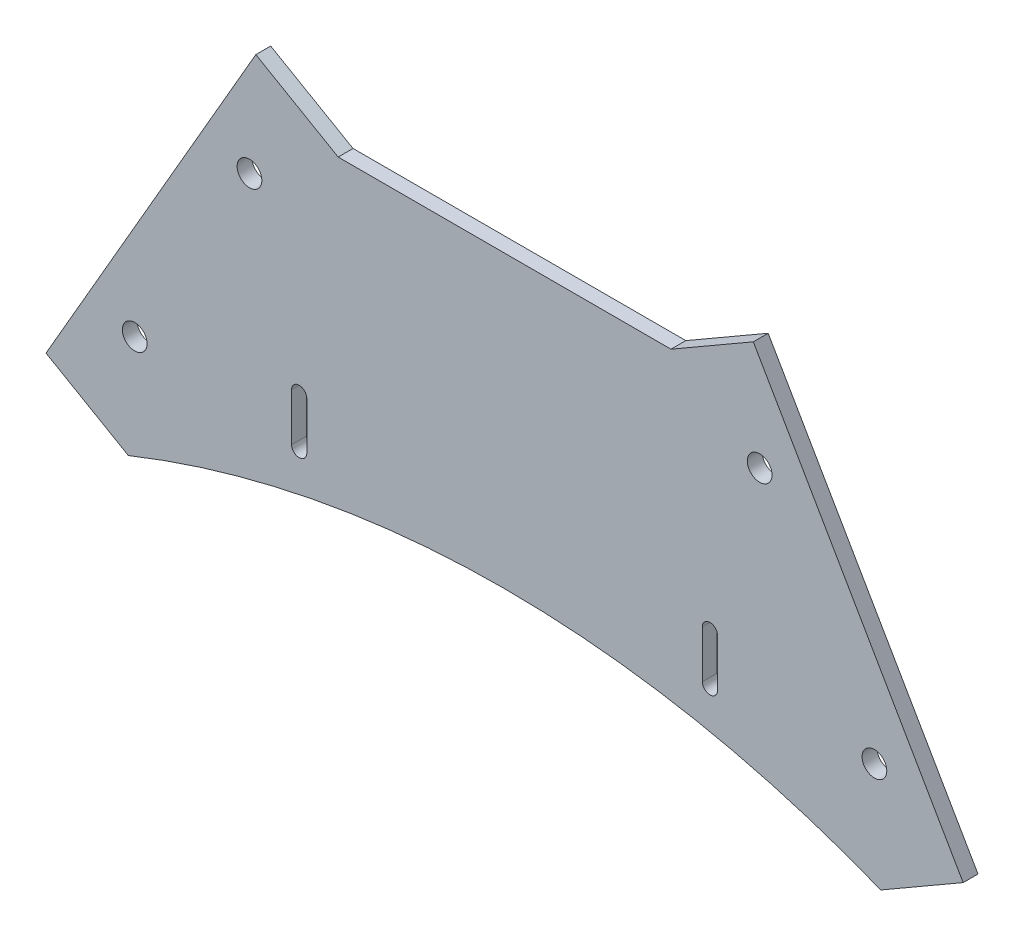
ISO-10303-21;
HEADER;
FILE_DESCRIPTION(('STEP AP214'),'2;1');
FILE_NAME('part.step','',(''),(''),'','','');
FILE_SCHEMA(('AUTOMOTIVE_DESIGN { 1 0 10303 214 1 1 1 1 }'));
ENDSEC;
DATA;
#1=APPLICATION_CONTEXT('core data for automotive mechanical design processes');
#2=APPLICATION_PROTOCOL_DEFINITION('international standard','automotive_design',2000,#1);
#3=PRODUCT_CONTEXT('',#1,'mechanical');
#4=PRODUCT('Part','Part','',(#3));
#5=PRODUCT_RELATED_PRODUCT_CATEGORY('part','',(#4));
#6=PRODUCT_DEFINITION_FORMATION('','',#4);
#7=PRODUCT_DEFINITION_CONTEXT('part definition',#1,'design');
#8=PRODUCT_DEFINITION('design','',#6,#7);
#9=PRODUCT_DEFINITION_SHAPE('','',#8);
#10=(LENGTH_UNIT() NAMED_UNIT(*) SI_UNIT(.MILLI.,.METRE.));
#11=(NAMED_UNIT(*) PLANE_ANGLE_UNIT() SI_UNIT($,.RADIAN.));
#12=(NAMED_UNIT(*) SI_UNIT($,.STERADIAN.) SOLID_ANGLE_UNIT());
#13=UNCERTAINTY_MEASURE_WITH_UNIT(LENGTH_MEASURE(1.E-05),#10,'distance_accuracy_value','');
#14=(GEOMETRIC_REPRESENTATION_CONTEXT(3) GLOBAL_UNCERTAINTY_ASSIGNED_CONTEXT((#13)) GLOBAL_UNIT_ASSIGNED_CONTEXT((#10,
#11,#12)) REPRESENTATION_CONTEXT('',''));
#15=CARTESIAN_POINT('',(0.,0.,0.));
#16=DIRECTION('',(0.,0.,1.));
#17=DIRECTION('',(1.,0.,0.));
#18=AXIS2_PLACEMENT_3D('',#15,#16,#17);
#19=CARTESIAN_POINT('',(96.4557505594944,-196.799575907765,3.125));
#20=DIRECTION('',(0.,0.,1.));
#21=DIRECTION('',(1.,0.,0.));
#22=AXIS2_PLACEMENT_3D('',#19,#20,#21);
#23=PLANE('',#22);
#24=CARTESIAN_POINT('',(150.116004597338,64.1239743106391,3.125));
#25=DIRECTION('',(0.,0.,1.));
#26=DIRECTION('',(1.,0.,0.));
#27=AXIS2_PLACEMENT_3D('',#24,#25,#26);
#28=CIRCLE('',#27,2.60000000000102);
#29=CARTESIAN_POINT('',(152.716004597339,64.1239743106391,3.125));
#30=VERTEX_POINT('',#29);
#31=EDGE_CURVE('E401',#30,#30,#28,.T.);
#32=ORIENTED_EDGE('',*,*,#31,.F.);
#33=EDGE_LOOP('',(#32));
#34=FACE_BOUND('',#33,.T.);
#35=CARTESIAN_POINT('',(42.7954965216511,64.1239743106392,3.125));
#36=DIRECTION('',(0.,0.,1.));
#37=DIRECTION('',(1.,0.,0.));
#38=AXIS2_PLACEMENT_3D('',#35,#36,#37);
#39=CIRCLE('',#38,2.5999999999994);
#40=CARTESIAN_POINT('',(45.3954965216505,64.1239743106392,3.125));
#41=VERTEX_POINT('',#40);
#42=EDGE_CURVE('E175',#41,#41,#39,.T.);
#43=ORIENTED_EDGE('',*,*,#42,.F.);
#44=EDGE_LOOP('',(#43));
#45=FACE_BOUND('',#44,.T.);
#46=CARTESIAN_POINT('',(96.4557505594944,-196.799575907765,3.125));
#47=DIRECTION('',(0.,0.,-1.));
#48=DIRECTION('',(1.,0.,0.));
#49=AXIS2_PLACEMENT_3D('',#46,#47,#48);
#50=CIRCLE('',#49,212.114260907765);
#51=CARTESIAN_POINT('',(17.3205080756887,1.6826817716975E-12,3.125));
#52=VERTEX_POINT('',#51);
#53=CARTESIAN_POINT('',(175.590993043302,1.9550500436325E-12,3.125));
#54=VERTEX_POINT('',#53);
#55=EDGE_CURVE('E216',#52,#54,#50,.T.);
#56=ORIENTED_EDGE('',*,*,#55,.T.);
#57=DIRECTION('',(0.866025403784439,0.499999999999999,0.));
#58=VECTOR('',#57,1.);
#59=CARTESIAN_POINT('',(175.590993043302,1.9550500436325E-12,3.125));
#60=LINE('',#59,#58);
#61=CARTESIAN_POINT('',(192.91150111899,10.0000000000016,3.125));
#62=VERTEX_POINT('',#61);
#63=EDGE_CURVE('E219',#54,#62,#60,.T.);
#64=ORIENTED_EDGE('',*,*,#63,.T.);
#65=DIRECTION('',(-0.499999999999998,0.86602540378444,0.));
#66=VECTOR('',#65,1.);
#67=CARTESIAN_POINT('',(148.776258635184,86.4444823863268,3.125));
#68=LINE('',#67,#66);
#69=CARTESIAN_POINT('',(148.776258635184,86.4444823863268,3.125));
#70=VERTEX_POINT('',#69);
#71=EDGE_CURVE('E222',#62,#70,#68,.T.);
#72=ORIENTED_EDGE('',*,*,#71,.T.);
#73=DIRECTION('',(-0.86602540378444,-0.499999999999997,0.));
#74=VECTOR('',#73,1.);
#75=CARTESIAN_POINT('',(131.455750559495,76.4444823863269,3.125));
#76=LINE('',#75,#74);
#77=CARTESIAN_POINT('',(131.455750559495,76.4444823863269,3.125));
#78=VERTEX_POINT('',#77);
#79=EDGE_CURVE('E224',#70,#78,#76,.T.);
#80=ORIENTED_EDGE('',*,*,#79,.T.);
#81=DIRECTION('',(-1.,0.,0.));
#82=VECTOR('',#81,1.);
#83=CARTESIAN_POINT('',(61.4557505594949,76.4444823863269,3.125));
#84=LINE('',#83,#82);
#85=CARTESIAN_POINT('',(61.4557505594949,76.4444823863269,3.125));
#86=VERTEX_POINT('',#85);
#87=EDGE_CURVE('E226',#78,#86,#84,.T.);
#88=ORIENTED_EDGE('',*,*,#87,.T.);
#89=DIRECTION('',(-0.86602540378444,0.499999999999998,0.));
#90=VECTOR('',#89,1.);
#91=CARTESIAN_POINT('',(61.4557505594949,76.4444823863269,3.125));
#92=LINE('',#91,#90);
#93=CARTESIAN_POINT('',(44.1352424838062,86.4444823863268,3.125));
#94=VERTEX_POINT('',#93);
#95=EDGE_CURVE('E228',#86,#94,#92,.T.);
#96=ORIENTED_EDGE('',*,*,#95,.T.);
#97=DIRECTION('',(-0.499999999999997,-0.86602540378444,0.));
#98=VECTOR('',#97,1.);
#99=CARTESIAN_POINT('',(44.1352424838062,86.4444823863268,3.125));
#100=LINE('',#99,#98);
#101=CARTESIAN_POINT('',(0.,10.0000000000016,3.125));
#102=VERTEX_POINT('',#101);
#103=EDGE_CURVE('E230',#94,#102,#100,.T.);
#104=ORIENTED_EDGE('',*,*,#103,.T.);
#105=DIRECTION('',(0.866025403784439,-0.499999999999999,0.));
#106=VECTOR('',#105,1.);
#107=CARTESIAN_POINT('',(17.3205080756887,1.6826817716975E-12,3.125));
#108=LINE('',#107,#106);
#109=EDGE_CURVE('E232',#102,#52,#108,.T.);
#110=ORIENTED_EDGE('',*,*,#109,.T.);
#111=EDGE_LOOP('',(#56,#64,#72,#80,#88,#96,#104,#110));
#112=FACE_BOUND('',#111,.T.);
#113=DIRECTION('',(0.,-1.,0.));
#114=VECTOR('',#113,1.);
#115=CARTESIAN_POINT('',(51.6557505594943,29.1748337660113,3.125));
#116=LINE('',#115,#114);
#117=CARTESIAN_POINT('',(51.6557505594943,29.1748337660113,3.125));
#118=VERTEX_POINT('',#117);
#119=CARTESIAN_POINT('',(51.6557505594943,19.1748337660114,3.125));
#120=VERTEX_POINT('',#119);
#121=EDGE_CURVE('E187',#118,#120,#116,.T.);
#122=ORIENTED_EDGE('',*,*,#121,.F.);
#123=CARTESIAN_POINT('',(53.2557505594943,29.1748337660113,3.125));
#124=DIRECTION('',(0.,0.,1.));
#125=DIRECTION('',(1.,0.,0.));
#126=AXIS2_PLACEMENT_3D('',#123,#124,#125);
#127=CIRCLE('',#126,1.59999999999999);
#128=CARTESIAN_POINT('',(54.8557505594943,29.1748337660113,3.125));
#129=VERTEX_POINT('',#128);
#130=EDGE_CURVE('E185',#129,#118,#127,.T.);
#131=ORIENTED_EDGE('',*,*,#130,.F.);
#132=DIRECTION('',(0.,1.,0.));
#133=VECTOR('',#132,1.);
#134=CARTESIAN_POINT('',(54.8557505594943,29.1748337660113,3.125));
#135=LINE('',#134,#133);
#136=CARTESIAN_POINT('',(54.8557505594943,19.1748337660114,3.125));
#137=VERTEX_POINT('',#136);
#138=EDGE_CURVE('E193',#137,#129,#135,.T.);
#139=ORIENTED_EDGE('',*,*,#138,.F.);
#140=CARTESIAN_POINT('',(53.2557505594943,19.1748337660114,3.125));
#141=DIRECTION('',(0.,0.,1.));
#142=DIRECTION('',(1.,0.,0.));
#143=AXIS2_PLACEMENT_3D('',#140,#141,#142);
#144=CIRCLE('',#143,1.59999999999999);
#145=EDGE_CURVE('E190',#120,#137,#144,.T.);
#146=ORIENTED_EDGE('',*,*,#145,.F.);
#147=EDGE_LOOP('',(#122,#131,#139,#146));
#148=FACE_BOUND('',#147,.T.);
#149=DIRECTION('',(0.,1.,0.));
#150=VECTOR('',#149,1.);
#151=CARTESIAN_POINT('',(141.255750559494,29.1748337660113,3.125));
#152=LINE('',#151,#150);
#153=CARTESIAN_POINT('',(141.255750559494,19.1748337660114,3.125));
#154=VERTEX_POINT('',#153);
#155=CARTESIAN_POINT('',(141.255750559494,29.1748337660113,3.125));
#156=VERTEX_POINT('',#155);
#157=EDGE_CURVE('E154',#154,#156,#152,.T.);
#158=ORIENTED_EDGE('',*,*,#157,.F.);
#159=CARTESIAN_POINT('',(139.655750559494,19.1748337660114,3.125));
#160=DIRECTION('',(0.,0.,1.));
#161=DIRECTION('',(1.,0.,0.));
#162=AXIS2_PLACEMENT_3D('',#159,#160,#161);
#163=CIRCLE('',#162,1.59999999999999);
#164=CARTESIAN_POINT('',(138.055750559494,19.1748337660114,3.125));
#165=VERTEX_POINT('',#164);
#166=EDGE_CURVE('E146',#165,#154,#163,.T.);
#167=ORIENTED_EDGE('',*,*,#166,.F.);
#168=DIRECTION('',(0.,-1.,0.));
#169=VECTOR('',#168,1.);
#170=CARTESIAN_POINT('',(138.055750559494,29.1748337660113,3.125));
#171=LINE('',#170,#169);
#172=CARTESIAN_POINT('',(138.055750559494,29.1748337660113,3.125));
#173=VERTEX_POINT('',#172);
#174=EDGE_CURVE('E169',#173,#165,#171,.T.);
#175=ORIENTED_EDGE('',*,*,#174,.F.);
#176=CARTESIAN_POINT('',(139.655750559494,29.1748337660113,3.125));
#177=DIRECTION('',(0.,0.,1.));
#178=DIRECTION('',(1.,0.,0.));
#179=AXIS2_PLACEMENT_3D('',#176,#177,#178);
#180=CIRCLE('',#179,1.59999999999999);
#181=EDGE_CURVE('E167',#156,#173,#180,.T.);
#182=ORIENTED_EDGE('',*,*,#181,.F.);
#183=EDGE_LOOP('',(#158,#167,#175,#182));
#184=FACE_BOUND('',#183,.T.);
#185=CARTESIAN_POINT('',(18.6602540378437,22.3205080756896,3.125));
#186=DIRECTION('',(0.,0.,1.));
#187=DIRECTION('',(1.,0.,0.));
#188=AXIS2_PLACEMENT_3D('',#185,#186,#187);
#189=CIRCLE('',#188,2.60000000000056);
#190=CARTESIAN_POINT('',(21.2602540378442,22.3205080756896,3.125));
#191=VERTEX_POINT('',#190);
#192=EDGE_CURVE('E407',#191,#191,#189,.T.);
#193=ORIENTED_EDGE('',*,*,#192,.F.);
#194=EDGE_LOOP('',(#193));
#195=FACE_BOUND('',#194,.T.);
#196=CARTESIAN_POINT('',(174.251247081145,22.3205080756895,3.125));
#197=DIRECTION('',(0.,0.,1.));
#198=DIRECTION('',(1.,0.,0.));
#199=AXIS2_PLACEMENT_3D('',#196,#197,#198);
#200=CIRCLE('',#199,2.60000000000135);
#201=CARTESIAN_POINT('',(176.851247081147,22.3205080756895,3.125));
#202=VERTEX_POINT('',#201);
#203=EDGE_CURVE('E392',#202,#202,#200,.T.);
#204=ORIENTED_EDGE('',*,*,#203,.F.);
#205=EDGE_LOOP('',(#204));
#206=FACE_BOUND('',#205,.T.);
#207=ADVANCED_FACE('F33',(#34,#45,#112,#148,#184,#195,#206),#23,.T.);
#208=CARTESIAN_POINT('',(96.4557505594944,-196.799575907765,0.));
#209=DIRECTION('',(0.,0.,1.));
#210=DIRECTION('',(1.,0.,0.));
#211=AXIS2_PLACEMENT_3D('',#208,#209,#210);
#212=PLANE('',#211);
#213=CARTESIAN_POINT('',(53.2557505594943,29.1748337660113,0.));
#214=DIRECTION('',(0.,0.,1.));
#215=DIRECTION('',(1.,0.,0.));
#216=AXIS2_PLACEMENT_3D('',#213,#214,#215);
#217=CIRCLE('',#216,1.59999999999999);
#218=CARTESIAN_POINT('',(54.8557505594943,29.1748337660113,0.));
#219=VERTEX_POINT('',#218);
#220=CARTESIAN_POINT('',(51.6557505594943,29.1748337660113,0.));
#221=VERTEX_POINT('',#220);
#222=EDGE_CURVE('E162',#219,#221,#217,.T.);
#223=ORIENTED_EDGE('',*,*,#222,.T.);
#224=DIRECTION('',(0.,-1.,0.));
#225=VECTOR('',#224,1.);
#226=CARTESIAN_POINT('',(51.6557505594943,29.1748337660113,0.));
#227=LINE('',#226,#225);
#228=CARTESIAN_POINT('',(51.6557505594943,19.1748337660114,0.));
#229=VERTEX_POINT('',#228);
#230=EDGE_CURVE('E198',#221,#229,#227,.T.);
#231=ORIENTED_EDGE('',*,*,#230,.T.);
#232=CARTESIAN_POINT('',(53.2557505594943,19.1748337660114,0.));
#233=DIRECTION('',(0.,0.,1.));
#234=DIRECTION('',(1.,0.,0.));
#235=AXIS2_PLACEMENT_3D('',#232,#233,#234);
#236=CIRCLE('',#235,1.59999999999999);
#237=CARTESIAN_POINT('',(54.8557505594943,19.1748337660114,0.));
#238=VERTEX_POINT('',#237);
#239=EDGE_CURVE('E201',#229,#238,#236,.T.);
#240=ORIENTED_EDGE('',*,*,#239,.T.);
#241=DIRECTION('',(0.,1.,0.));
#242=VECTOR('',#241,1.);
#243=CARTESIAN_POINT('',(54.8557505594943,29.1748337660113,0.));
#244=LINE('',#243,#242);
#245=EDGE_CURVE('E188',#238,#219,#244,.T.);
#246=ORIENTED_EDGE('',*,*,#245,.T.);
#247=EDGE_LOOP('',(#223,#231,#240,#246));
#248=FACE_BOUND('',#247,.T.);
#249=CARTESIAN_POINT('',(96.4557505594944,-196.799575907765,0.));
#250=DIRECTION('',(0.,0.,-1.));
#251=DIRECTION('',(1.,0.,0.));
#252=AXIS2_PLACEMENT_3D('',#249,#250,#251);
#253=CIRCLE('',#252,212.114260907765);
#254=CARTESIAN_POINT('',(17.3205080756887,1.6826817716975E-12,0.));
#255=VERTEX_POINT('',#254);
#256=CARTESIAN_POINT('',(175.590993043302,1.9550500436325E-12,0.));
#257=VERTEX_POINT('',#256);
#258=EDGE_CURVE('E215',#255,#257,#253,.T.);
#259=ORIENTED_EDGE('',*,*,#258,.F.);
#260=DIRECTION('',(0.866025403784439,-0.499999999999999,0.));
#261=VECTOR('',#260,1.);
#262=CARTESIAN_POINT('',(17.3205080756887,1.6826817716975E-12,0.));
#263=LINE('',#262,#261);
#264=CARTESIAN_POINT('',(0.,10.0000000000016,0.));
#265=VERTEX_POINT('',#264);
#266=EDGE_CURVE('E220',#265,#255,#263,.T.);
#267=ORIENTED_EDGE('',*,*,#266,.F.);
#268=DIRECTION('',(-0.499999999999997,-0.86602540378444,0.));
#269=VECTOR('',#268,1.);
#270=CARTESIAN_POINT('',(44.1352424838062,86.4444823863268,0.));
#271=LINE('',#270,#269);
#272=CARTESIAN_POINT('',(44.1352424838062,86.4444823863268,0.));
#273=VERTEX_POINT('',#272);
#274=EDGE_CURVE('E247',#273,#265,#271,.T.);
#275=ORIENTED_EDGE('',*,*,#274,.F.);
#276=DIRECTION('',(-0.86602540378444,0.499999999999998,0.));
#277=VECTOR('',#276,1.);
#278=CARTESIAN_POINT('',(61.4557505594949,76.4444823863269,0.));
#279=LINE('',#278,#277);
#280=CARTESIAN_POINT('',(61.4557505594949,76.4444823863269,0.));
#281=VERTEX_POINT('',#280);
#282=EDGE_CURVE('E245',#281,#273,#279,.T.);
#283=ORIENTED_EDGE('',*,*,#282,.F.);
#284=DIRECTION('',(-1.,0.,0.));
#285=VECTOR('',#284,1.);
#286=CARTESIAN_POINT('',(61.4557505594949,76.4444823863269,0.));
#287=LINE('',#286,#285);
#288=CARTESIAN_POINT('',(131.455750559495,76.4444823863269,0.));
#289=VERTEX_POINT('',#288);
#290=EDGE_CURVE('E243',#289,#281,#287,.T.);
#291=ORIENTED_EDGE('',*,*,#290,.F.);
#292=DIRECTION('',(-0.86602540378444,-0.499999999999997,0.));
#293=VECTOR('',#292,1.);
#294=CARTESIAN_POINT('',(131.455750559495,76.4444823863269,0.));
#295=LINE('',#294,#293);
#296=CARTESIAN_POINT('',(148.776258635184,86.4444823863268,0.));
#297=VERTEX_POINT('',#296);
#298=EDGE_CURVE('E241',#297,#289,#295,.T.);
#299=ORIENTED_EDGE('',*,*,#298,.F.);
#300=DIRECTION('',(-0.499999999999998,0.86602540378444,0.));
#301=VECTOR('',#300,1.);
#302=CARTESIAN_POINT('',(148.776258635184,86.4444823863268,0.));
#303=LINE('',#302,#301);
#304=CARTESIAN_POINT('',(192.91150111899,10.0000000000016,0.));
#305=VERTEX_POINT('',#304);
#306=EDGE_CURVE('E239',#305,#297,#303,.T.);
#307=ORIENTED_EDGE('',*,*,#306,.F.);
#308=DIRECTION('',(0.866025403784439,0.499999999999999,0.));
#309=VECTOR('',#308,1.);
#310=CARTESIAN_POINT('',(175.590993043302,1.9550500436325E-12,0.));
#311=LINE('',#310,#309);
#312=EDGE_CURVE('E237',#257,#305,#311,.T.);
#313=ORIENTED_EDGE('',*,*,#312,.F.);
#314=EDGE_LOOP('',(#259,#267,#275,#283,#291,#299,#307,#313));
#315=FACE_BOUND('',#314,.T.);
#316=CARTESIAN_POINT('',(139.655750559494,19.1748337660114,0.));
#317=DIRECTION('',(0.,0.,1.));
#318=DIRECTION('',(1.,0.,0.));
#319=AXIS2_PLACEMENT_3D('',#316,#317,#318);
#320=CIRCLE('',#319,1.59999999999999);
#321=CARTESIAN_POINT('',(138.055750559494,19.1748337660114,0.));
#322=VERTEX_POINT('',#321);
#323=CARTESIAN_POINT('',(141.255750559494,19.1748337660114,0.));
#324=VERTEX_POINT('',#323);
#325=EDGE_CURVE('E56',#322,#324,#320,.T.);
#326=ORIENTED_EDGE('',*,*,#325,.T.);
#327=DIRECTION('',(0.,1.,0.));
#328=VECTOR('',#327,1.);
#329=CARTESIAN_POINT('',(141.255750559494,29.1748337660113,0.));
#330=LINE('',#329,#328);
#331=CARTESIAN_POINT('',(141.255750559494,29.1748337660113,0.));
#332=VERTEX_POINT('',#331);
#333=EDGE_CURVE('E161',#324,#332,#330,.T.);
#334=ORIENTED_EDGE('',*,*,#333,.T.);
#335=CARTESIAN_POINT('',(139.655750559494,29.1748337660113,0.));
#336=DIRECTION('',(0.,0.,1.));
#337=DIRECTION('',(1.,0.,0.));
#338=AXIS2_PLACEMENT_3D('',#335,#336,#337);
#339=CIRCLE('',#338,1.59999999999999);
#340=CARTESIAN_POINT('',(138.055750559494,29.1748337660113,0.));
#341=VERTEX_POINT('',#340);
#342=EDGE_CURVE('E177',#332,#341,#339,.T.);
#343=ORIENTED_EDGE('',*,*,#342,.T.);
#344=DIRECTION('',(0.,-1.,0.));
#345=VECTOR('',#344,1.);
#346=CARTESIAN_POINT('',(138.055750559494,29.1748337660113,0.));
#347=LINE('',#346,#345);
#348=EDGE_CURVE('E155',#341,#322,#347,.T.);
#349=ORIENTED_EDGE('',*,*,#348,.T.);
#350=EDGE_LOOP('',(#326,#334,#343,#349));
#351=FACE_BOUND('',#350,.T.);
#352=CARTESIAN_POINT('',(42.7954965216511,64.1239743106392,0.));
#353=DIRECTION('',(0.,0.,1.));
#354=DIRECTION('',(1.,0.,0.));
#355=AXIS2_PLACEMENT_3D('',#352,#353,#354);
#356=CIRCLE('',#355,2.5999999999994);
#357=CARTESIAN_POINT('',(45.3954965216505,64.1239743106392,0.));
#358=VERTEX_POINT('',#357);
#359=EDGE_CURVE('E410',#358,#358,#356,.T.);
#360=ORIENTED_EDGE('',*,*,#359,.T.);
#361=EDGE_LOOP('',(#360));
#362=FACE_BOUND('',#361,.T.);
#363=CARTESIAN_POINT('',(18.6602540378437,22.3205080756896,0.));
#364=DIRECTION('',(0.,0.,1.));
#365=DIRECTION('',(1.,0.,0.));
#366=AXIS2_PLACEMENT_3D('',#363,#364,#365);
#367=CIRCLE('',#366,2.60000000000056);
#368=CARTESIAN_POINT('',(21.2602540378442,22.3205080756896,0.));
#369=VERTEX_POINT('',#368);
#370=EDGE_CURVE('E404',#369,#369,#367,.T.);
#371=ORIENTED_EDGE('',*,*,#370,.T.);
#372=EDGE_LOOP('',(#371));
#373=FACE_BOUND('',#372,.T.);
#374=CARTESIAN_POINT('',(150.116004597338,64.1239743106391,0.));
#375=DIRECTION('',(0.,0.,1.));
#376=DIRECTION('',(1.,0.,0.));
#377=AXIS2_PLACEMENT_3D('',#374,#375,#376);
#378=CIRCLE('',#377,2.60000000000102);
#379=CARTESIAN_POINT('',(152.716004597339,64.1239743106391,0.));
#380=VERTEX_POINT('',#379);
#381=EDGE_CURVE('E398',#380,#380,#378,.T.);
#382=ORIENTED_EDGE('',*,*,#381,.T.);
#383=EDGE_LOOP('',(#382));
#384=FACE_BOUND('',#383,.T.);
#385=CARTESIAN_POINT('',(174.251247081145,22.3205080756895,0.));
#386=DIRECTION('',(0.,0.,1.));
#387=DIRECTION('',(1.,0.,0.));
#388=AXIS2_PLACEMENT_3D('',#385,#386,#387);
#389=CIRCLE('',#388,2.60000000000135);
#390=CARTESIAN_POINT('',(176.851247081147,22.3205080756895,0.));
#391=VERTEX_POINT('',#390);
#392=EDGE_CURVE('E395',#391,#391,#389,.T.);
#393=ORIENTED_EDGE('',*,*,#392,.T.);
#394=EDGE_LOOP('',(#393));
#395=FACE_BOUND('',#394,.T.);
#396=ADVANCED_FACE('F277',(#248,#315,#351,#362,#373,#384,#395),#212,.F.);
#397=CARTESIAN_POINT('',(96.4557505594944,-196.799575907765,3.125));
#398=DIRECTION('',(0.,0.,-1.));
#399=DIRECTION('',(-1.,0.,0.));
#400=AXIS2_PLACEMENT_3D('',#397,#398,#399);
#401=CYLINDRICAL_SURFACE('',#400,212.114260907765);
#402=ORIENTED_EDGE('',*,*,#258,.T.);
#403=DIRECTION('',(0.,0.,-1.));
#404=VECTOR('',#403,1.);
#405=CARTESIAN_POINT('',(175.590993043302,1.9550500436325E-12,3.125));
#406=LINE('',#405,#404);
#407=EDGE_CURVE('E11',#54,#257,#406,.T.);
#408=ORIENTED_EDGE('',*,*,#407,.F.);
#409=ORIENTED_EDGE('',*,*,#55,.F.);
#410=DIRECTION('',(0.,0.,-1.));
#411=VECTOR('',#410,1.);
#412=CARTESIAN_POINT('',(17.3205080756887,1.6826817716975E-12,3.125));
#413=LINE('',#412,#411);
#414=EDGE_CURVE('E234',#52,#255,#413,.T.);
#415=ORIENTED_EDGE('',*,*,#414,.T.);
#416=EDGE_LOOP('',(#402,#408,#409,#415));
#417=FACE_BOUND('',#416,.T.);
#418=ADVANCED_FACE('F35',(#417),#401,.F.);
#419=CARTESIAN_POINT('',(175.590993043302,1.9550500436325E-12,3.125));
#420=DIRECTION('',(-0.499999999999999,0.866025403784439,0.));
#421=DIRECTION('',(-0.866025403784439,-0.499999999999999,0.));
#422=AXIS2_PLACEMENT_3D('',#419,#420,#421);
#423=PLANE('',#422);
#424=ORIENTED_EDGE('',*,*,#312,.T.);
#425=DIRECTION('',(0.,0.,-1.));
#426=VECTOR('',#425,1.);
#427=CARTESIAN_POINT('',(192.91150111899,10.0000000000016,3.125));
#428=LINE('',#427,#426);
#429=EDGE_CURVE('E41',#62,#305,#428,.T.);
#430=ORIENTED_EDGE('',*,*,#429,.F.);
#431=ORIENTED_EDGE('',*,*,#63,.F.);
#432=ORIENTED_EDGE('',*,*,#407,.T.);
#433=EDGE_LOOP('',(#424,#430,#431,#432));
#434=FACE_BOUND('',#433,.T.);
#435=ADVANCED_FACE('F295',(#434),#423,.F.);
#436=CARTESIAN_POINT('',(148.776258635184,86.4444823863268,3.125));
#437=DIRECTION('',(-0.86602540378444,-0.499999999999998,0.));
#438=DIRECTION('',(0.499999999999998,-0.86602540378444,0.));
#439=AXIS2_PLACEMENT_3D('',#436,#437,#438);
#440=PLANE('',#439);
#441=ORIENTED_EDGE('',*,*,#306,.T.);
#442=DIRECTION('',(0.,0.,-1.));
#443=VECTOR('',#442,1.);
#444=CARTESIAN_POINT('',(148.776258635184,86.4444823863268,3.125));
#445=LINE('',#444,#443);
#446=EDGE_CURVE('E264',#70,#297,#445,.T.);
#447=ORIENTED_EDGE('',*,*,#446,.F.);
#448=ORIENTED_EDGE('',*,*,#71,.F.);
#449=ORIENTED_EDGE('',*,*,#429,.T.);
#450=EDGE_LOOP('',(#441,#447,#448,#449));
#451=FACE_BOUND('',#450,.T.);
#452=ADVANCED_FACE('F271',(#451),#440,.F.);
#453=CARTESIAN_POINT('',(131.455750559495,76.4444823863269,3.125));
#454=DIRECTION('',(0.499999999999997,-0.86602540378444,0.));
#455=DIRECTION('',(0.86602540378444,0.499999999999997,0.));
#456=AXIS2_PLACEMENT_3D('',#453,#454,#455);
#457=PLANE('',#456);
#458=ORIENTED_EDGE('',*,*,#298,.T.);
#459=DIRECTION('',(0.,0.,-1.));
#460=VECTOR('',#459,1.);
#461=CARTESIAN_POINT('',(131.455750559495,76.4444823863269,3.125));
#462=LINE('',#461,#460);
#463=EDGE_CURVE('E261',#78,#289,#462,.T.);
#464=ORIENTED_EDGE('',*,*,#463,.F.);
#465=ORIENTED_EDGE('',*,*,#79,.F.);
#466=ORIENTED_EDGE('',*,*,#446,.T.);
#467=EDGE_LOOP('',(#458,#464,#465,#466));
#468=FACE_BOUND('',#467,.T.);
#469=ADVANCED_FACE('F283',(#468),#457,.F.);
#470=CARTESIAN_POINT('',(61.4557505594949,76.4444823863269,3.125));
#471=DIRECTION('',(0.,-1.,0.));
#472=DIRECTION('',(1.,0.,0.));
#473=AXIS2_PLACEMENT_3D('',#470,#471,#472);
#474=PLANE('',#473);
#475=ORIENTED_EDGE('',*,*,#290,.T.);
#476=DIRECTION('',(0.,0.,-1.));
#477=VECTOR('',#476,1.);
#478=CARTESIAN_POINT('',(61.4557505594949,76.4444823863269,3.125));
#479=LINE('',#478,#477);
#480=EDGE_CURVE('E258',#86,#281,#479,.T.);
#481=ORIENTED_EDGE('',*,*,#480,.F.);
#482=ORIENTED_EDGE('',*,*,#87,.F.);
#483=ORIENTED_EDGE('',*,*,#463,.T.);
#484=EDGE_LOOP('',(#475,#481,#482,#483));
#485=FACE_BOUND('',#484,.T.);
#486=ADVANCED_FACE('F287',(#485),#474,.F.);
#487=CARTESIAN_POINT('',(61.4557505594949,76.4444823863269,3.125));
#488=DIRECTION('',(-0.499999999999998,-0.86602540378444,0.));
#489=DIRECTION('',(0.86602540378444,-0.499999999999998,0.));
#490=AXIS2_PLACEMENT_3D('',#487,#488,#489);
#491=PLANE('',#490);
#492=ORIENTED_EDGE('',*,*,#282,.T.);
#493=DIRECTION('',(0.,0.,-1.));
#494=VECTOR('',#493,1.);
#495=CARTESIAN_POINT('',(44.1352424838062,86.4444823863268,3.125));
#496=LINE('',#495,#494);
#497=EDGE_CURVE('E255',#94,#273,#496,.T.);
#498=ORIENTED_EDGE('',*,*,#497,.F.);
#499=ORIENTED_EDGE('',*,*,#95,.F.);
#500=ORIENTED_EDGE('',*,*,#480,.T.);
#501=EDGE_LOOP('',(#492,#498,#499,#500));
#502=FACE_BOUND('',#501,.T.);
#503=ADVANCED_FACE('F308',(#502),#491,.F.);
#504=CARTESIAN_POINT('',(44.1352424838062,86.4444823863268,3.125));
#505=DIRECTION('',(0.86602540378444,-0.499999999999997,0.));
#506=DIRECTION('',(0.499999999999997,0.86602540378444,0.));
#507=AXIS2_PLACEMENT_3D('',#504,#505,#506);
#508=PLANE('',#507);
#509=ORIENTED_EDGE('',*,*,#274,.T.);
#510=DIRECTION('',(0.,0.,-1.));
#511=VECTOR('',#510,1.);
#512=CARTESIAN_POINT('',(0.,10.0000000000016,3.125));
#513=LINE('',#512,#511);
#514=EDGE_CURVE('E252',#102,#265,#513,.T.);
#515=ORIENTED_EDGE('',*,*,#514,.F.);
#516=ORIENTED_EDGE('',*,*,#103,.F.);
#517=ORIENTED_EDGE('',*,*,#497,.T.);
#518=EDGE_LOOP('',(#509,#515,#516,#517));
#519=FACE_BOUND('',#518,.T.);
#520=ADVANCED_FACE('F306',(#519),#508,.F.);
#521=CARTESIAN_POINT('',(17.3205080756887,1.6826817716975E-12,3.125));
#522=DIRECTION('',(0.499999999999999,0.866025403784439,0.));
#523=DIRECTION('',(-0.866025403784439,0.499999999999999,0.));
#524=AXIS2_PLACEMENT_3D('',#521,#522,#523);
#525=PLANE('',#524);
#526=ORIENTED_EDGE('',*,*,#266,.T.);
#527=ORIENTED_EDGE('',*,*,#414,.F.);
#528=ORIENTED_EDGE('',*,*,#109,.F.);
#529=ORIENTED_EDGE('',*,*,#514,.T.);
#530=EDGE_LOOP('',(#526,#527,#528,#529));
#531=FACE_BOUND('',#530,.T.);
#532=ADVANCED_FACE('F301',(#531),#525,.F.);
#533=CARTESIAN_POINT('',(53.2557505594943,29.1748337660113,3.125));
#534=DIRECTION('',(0.,0.,-1.));
#535=DIRECTION('',(-1.,0.,0.));
#536=AXIS2_PLACEMENT_3D('',#533,#534,#535);
#537=CYLINDRICAL_SURFACE('',#536,1.59999999999999);
#538=ORIENTED_EDGE('',*,*,#222,.F.);
#539=DIRECTION('',(0.,0.,-1.));
#540=VECTOR('',#539,1.);
#541=CARTESIAN_POINT('',(54.8557505594943,29.1748337660113,3.125));
#542=LINE('',#541,#540);
#543=EDGE_CURVE('E195',#129,#219,#542,.T.);
#544=ORIENTED_EDGE('',*,*,#543,.F.);
#545=ORIENTED_EDGE('',*,*,#130,.T.);
#546=DIRECTION('',(0.,0.,-1.));
#547=VECTOR('',#546,1.);
#548=CARTESIAN_POINT('',(51.6557505594943,29.1748337660113,3.125));
#549=LINE('',#548,#547);
#550=EDGE_CURVE('E212',#118,#221,#549,.T.);
#551=ORIENTED_EDGE('',*,*,#550,.T.);
#552=EDGE_LOOP('',(#538,#544,#545,#551));
#553=FACE_BOUND('',#552,.T.);
#554=ADVANCED_FACE('F328',(#553),#537,.F.);
#555=CARTESIAN_POINT('',(51.6557505594943,29.1748337660113,3.125));
#556=DIRECTION('',(1.,0.,0.));
#557=DIRECTION('',(0.,0.,-1.));
#558=AXIS2_PLACEMENT_3D('',#555,#556,#557);
#559=PLANE('',#558);
#560=ORIENTED_EDGE('',*,*,#230,.F.);
#561=ORIENTED_EDGE('',*,*,#550,.F.);
#562=ORIENTED_EDGE('',*,*,#121,.T.);
#563=DIRECTION('',(0.,0.,-1.));
#564=VECTOR('',#563,1.);
#565=CARTESIAN_POINT('',(51.6557505594943,19.1748337660114,3.125));
#566=LINE('',#565,#564);
#567=EDGE_CURVE('E210',#120,#229,#566,.T.);
#568=ORIENTED_EDGE('',*,*,#567,.T.);
#569=EDGE_LOOP('',(#560,#561,#562,#568));
#570=FACE_BOUND('',#569,.T.);
#571=ADVANCED_FACE('F335',(#570),#559,.T.);
#572=CARTESIAN_POINT('',(53.2557505594943,19.1748337660114,3.125));
#573=DIRECTION('',(0.,0.,-1.));
#574=DIRECTION('',(-1.,0.,0.));
#575=AXIS2_PLACEMENT_3D('',#572,#573,#574);
#576=CYLINDRICAL_SURFACE('',#575,1.59999999999999);
#577=ORIENTED_EDGE('',*,*,#239,.F.);
#578=ORIENTED_EDGE('',*,*,#567,.F.);
#579=ORIENTED_EDGE('',*,*,#145,.T.);
#580=DIRECTION('',(0.,0.,-1.));
#581=VECTOR('',#580,1.);
#582=CARTESIAN_POINT('',(54.8557505594943,19.1748337660114,3.125));
#583=LINE('',#582,#581);
#584=EDGE_CURVE('E208',#137,#238,#583,.T.);
#585=ORIENTED_EDGE('',*,*,#584,.T.);
#586=EDGE_LOOP('',(#577,#578,#579,#585));
#587=FACE_BOUND('',#586,.T.);
#588=ADVANCED_FACE('F340',(#587),#576,.F.);
#589=CARTESIAN_POINT('',(54.8557505594943,29.1748337660113,3.125));
#590=DIRECTION('',(-1.,0.,0.));
#591=DIRECTION('',(0.,0.,1.));
#592=AXIS2_PLACEMENT_3D('',#589,#590,#591);
#593=PLANE('',#592);
#594=ORIENTED_EDGE('',*,*,#245,.F.);
#595=ORIENTED_EDGE('',*,*,#584,.F.);
#596=ORIENTED_EDGE('',*,*,#138,.T.);
#597=ORIENTED_EDGE('',*,*,#543,.T.);
#598=EDGE_LOOP('',(#594,#595,#596,#597));
#599=FACE_BOUND('',#598,.T.);
#600=ADVANCED_FACE('F347',(#599),#593,.T.);
#601=CARTESIAN_POINT('',(139.655750559494,19.1748337660114,3.125));
#602=DIRECTION('',(0.,0.,-1.));
#603=DIRECTION('',(-1.,0.,0.));
#604=AXIS2_PLACEMENT_3D('',#601,#602,#603);
#605=CYLINDRICAL_SURFACE('',#604,1.59999999999999);
#606=ORIENTED_EDGE('',*,*,#325,.F.);
#607=DIRECTION('',(0.,0.,-1.));
#608=VECTOR('',#607,1.);
#609=CARTESIAN_POINT('',(138.055750559494,19.1748337660114,3.125));
#610=LINE('',#609,#608);
#611=EDGE_CURVE('E150',#165,#322,#610,.T.);
#612=ORIENTED_EDGE('',*,*,#611,.F.);
#613=ORIENTED_EDGE('',*,*,#166,.T.);
#614=DIRECTION('',(0.,0.,-1.));
#615=VECTOR('',#614,1.);
#616=CARTESIAN_POINT('',(141.255750559494,19.1748337660114,3.125));
#617=LINE('',#616,#615);
#618=EDGE_CURVE('E149',#154,#324,#617,.T.);
#619=ORIENTED_EDGE('',*,*,#618,.T.);
#620=EDGE_LOOP('',(#606,#612,#613,#619));
#621=FACE_BOUND('',#620,.T.);
#622=ADVANCED_FACE('F148',(#621),#605,.F.);
#623=CARTESIAN_POINT('',(141.255750559494,29.1748337660113,3.125));
#624=DIRECTION('',(-1.,0.,0.));
#625=DIRECTION('',(0.,0.,1.));
#626=AXIS2_PLACEMENT_3D('',#623,#624,#625);
#627=PLANE('',#626);
#628=ORIENTED_EDGE('',*,*,#333,.F.);
#629=ORIENTED_EDGE('',*,*,#618,.F.);
#630=ORIENTED_EDGE('',*,*,#157,.T.);
#631=DIRECTION('',(0.,0.,-1.));
#632=VECTOR('',#631,1.);
#633=CARTESIAN_POINT('',(141.255750559494,29.1748337660113,3.125));
#634=LINE('',#633,#632);
#635=EDGE_CURVE('E163',#156,#332,#634,.T.);
#636=ORIENTED_EDGE('',*,*,#635,.T.);
#637=EDGE_LOOP('',(#628,#629,#630,#636));
#638=FACE_BOUND('',#637,.T.);
#639=ADVANCED_FACE('F158',(#638),#627,.T.);
#640=CARTESIAN_POINT('',(139.655750559494,29.1748337660113,3.125));
#641=DIRECTION('',(0.,0.,-1.));
#642=DIRECTION('',(-1.,0.,0.));
#643=AXIS2_PLACEMENT_3D('',#640,#641,#642);
#644=CYLINDRICAL_SURFACE('',#643,1.59999999999999);
#645=ORIENTED_EDGE('',*,*,#342,.F.);
#646=ORIENTED_EDGE('',*,*,#635,.F.);
#647=ORIENTED_EDGE('',*,*,#181,.T.);
#648=DIRECTION('',(0.,0.,-1.));
#649=VECTOR('',#648,1.);
#650=CARTESIAN_POINT('',(138.055750559494,29.1748337660113,3.125));
#651=LINE('',#650,#649);
#652=EDGE_CURVE('E48',#173,#341,#651,.T.);
#653=ORIENTED_EDGE('',*,*,#652,.T.);
#654=EDGE_LOOP('',(#645,#646,#647,#653));
#655=FACE_BOUND('',#654,.T.);
#656=ADVANCED_FACE('F365',(#655),#644,.F.);
#657=CARTESIAN_POINT('',(138.055750559494,29.1748337660113,3.125));
#658=DIRECTION('',(1.,0.,0.));
#659=DIRECTION('',(0.,0.,-1.));
#660=AXIS2_PLACEMENT_3D('',#657,#658,#659);
#661=PLANE('',#660);
#662=ORIENTED_EDGE('',*,*,#348,.F.);
#663=ORIENTED_EDGE('',*,*,#652,.F.);
#664=ORIENTED_EDGE('',*,*,#174,.T.);
#665=ORIENTED_EDGE('',*,*,#611,.T.);
#666=EDGE_LOOP('',(#662,#663,#664,#665));
#667=FACE_BOUND('',#666,.T.);
#668=ADVANCED_FACE('F368',(#667),#661,.T.);
#669=CARTESIAN_POINT('',(42.7954965216511,64.1239743106392,3.125));
#670=DIRECTION('',(0.,0.,-1.));
#671=DIRECTION('',(-1.,0.,0.));
#672=AXIS2_PLACEMENT_3D('',#669,#670,#671);
#673=CYLINDRICAL_SURFACE('',#672,2.5999999999994);
#674=ORIENTED_EDGE('',*,*,#42,.T.);
#675=EDGE_LOOP('',(#674));
#676=FACE_BOUND('',#675,.T.);
#677=ORIENTED_EDGE('',*,*,#359,.F.);
#678=EDGE_LOOP('',(#677));
#679=FACE_BOUND('',#678,.T.);
#680=ADVANCED_FACE('F372',(#676,#679),#673,.F.);
#681=CARTESIAN_POINT('',(18.6602540378437,22.3205080756896,3.125));
#682=DIRECTION('',(0.,0.,-1.));
#683=DIRECTION('',(-1.,0.,0.));
#684=AXIS2_PLACEMENT_3D('',#681,#682,#683);
#685=CYLINDRICAL_SURFACE('',#684,2.60000000000056);
#686=ORIENTED_EDGE('',*,*,#192,.T.);
#687=EDGE_LOOP('',(#686));
#688=FACE_BOUND('',#687,.T.);
#689=ORIENTED_EDGE('',*,*,#370,.F.);
#690=EDGE_LOOP('',(#689));
#691=FACE_BOUND('',#690,.T.);
#692=ADVANCED_FACE('F375',(#688,#691),#685,.F.);
#693=CARTESIAN_POINT('',(150.116004597338,64.1239743106391,3.125));
#694=DIRECTION('',(0.,0.,-1.));
#695=DIRECTION('',(-1.,0.,0.));
#696=AXIS2_PLACEMENT_3D('',#693,#694,#695);
#697=CYLINDRICAL_SURFACE('',#696,2.60000000000102);
#698=ORIENTED_EDGE('',*,*,#31,.T.);
#699=EDGE_LOOP('',(#698));
#700=FACE_BOUND('',#699,.T.);
#701=ORIENTED_EDGE('',*,*,#381,.F.);
#702=EDGE_LOOP('',(#701));
#703=FACE_BOUND('',#702,.T.);
#704=ADVANCED_FACE('F379',(#700,#703),#697,.F.);
#705=CARTESIAN_POINT('',(174.251247081145,22.3205080756895,3.125));
#706=DIRECTION('',(0.,0.,-1.));
#707=DIRECTION('',(-1.,0.,0.));
#708=AXIS2_PLACEMENT_3D('',#705,#706,#707);
#709=CYLINDRICAL_SURFACE('',#708,2.60000000000135);
#710=ORIENTED_EDGE('',*,*,#203,.T.);
#711=EDGE_LOOP('',(#710));
#712=FACE_BOUND('',#711,.T.);
#713=ORIENTED_EDGE('',*,*,#392,.F.);
#714=EDGE_LOOP('',(#713));
#715=FACE_BOUND('',#714,.T.);
#716=ADVANCED_FACE('F383',(#712,#715),#709,.F.);
#717=CLOSED_SHELL('',(#207,#396,#418,#435,#452,#469,#486,#503,#520,#532,#554,#571,#588,#600,
#622,#639,#656,#668,#680,#692,#704,#716));
#718=MANIFOLD_SOLID_BREP('B2',#717);
#719=ADVANCED_BREP_SHAPE_REPRESENTATION('',(#18,#718),#14);
#720=SHAPE_DEFINITION_REPRESENTATION(#9,#719);
ENDSEC;
END-ISO-10303-21;
